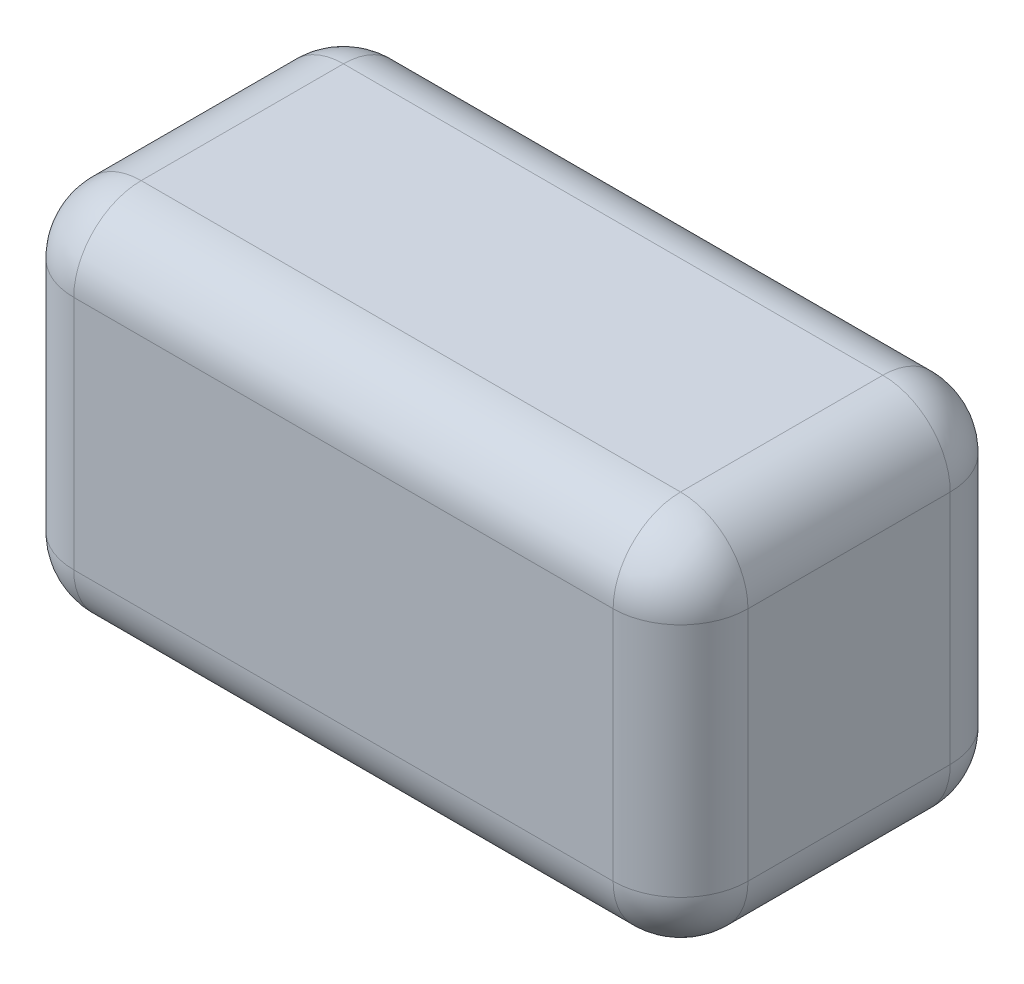
ISO-10303-21;
HEADER;
FILE_DESCRIPTION(('STEP AP214'),'2;1');
FILE_NAME('part.step','',(''),(''),'','','');
FILE_SCHEMA(('AUTOMOTIVE_DESIGN { 1 0 10303 214 1 1 1 1 }'));
ENDSEC;
DATA;
#1=APPLICATION_CONTEXT('core data for automotive mechanical design processes');
#2=APPLICATION_PROTOCOL_DEFINITION('international standard','automotive_design',2000,#1);
#3=PRODUCT_CONTEXT('',#1,'mechanical');
#4=PRODUCT('Part','Part','',(#3));
#5=PRODUCT_RELATED_PRODUCT_CATEGORY('part','',(#4));
#6=PRODUCT_DEFINITION_FORMATION('','',#4);
#7=PRODUCT_DEFINITION_CONTEXT('part definition',#1,'design');
#8=PRODUCT_DEFINITION('design','',#6,#7);
#9=PRODUCT_DEFINITION_SHAPE('','',#8);
#10=(LENGTH_UNIT() NAMED_UNIT(*) SI_UNIT(.MILLI.,.METRE.));
#11=(NAMED_UNIT(*) PLANE_ANGLE_UNIT() SI_UNIT($,.RADIAN.));
#12=(NAMED_UNIT(*) SI_UNIT($,.STERADIAN.) SOLID_ANGLE_UNIT());
#13=UNCERTAINTY_MEASURE_WITH_UNIT(LENGTH_MEASURE(1.E-05),#10,'distance_accuracy_value','');
#14=(GEOMETRIC_REPRESENTATION_CONTEXT(3) GLOBAL_UNCERTAINTY_ASSIGNED_CONTEXT((#13)) GLOBAL_UNIT_ASSIGNED_CONTEXT((#10,
#11,#12)) REPRESENTATION_CONTEXT('',''));
#15=CARTESIAN_POINT('',(0.,0.,0.));
#16=DIRECTION('',(0.,0.,1.));
#17=DIRECTION('',(1.,0.,0.));
#18=AXIS2_PLACEMENT_3D('',#15,#16,#17);
#19=CARTESIAN_POINT('',(0.4,0.1,-0.15));
#20=DIRECTION('',(1.,0.,0.));
#21=DIRECTION('',(0.,0.,-1.));
#22=AXIS2_PLACEMENT_3D('',#19,#20,#21);
#23=SPHERICAL_SURFACE('',#22,0.1);
#24=CARTESIAN_POINT('',(0.4,0.1,-0.15));
#25=DIRECTION('',(1.,0.,0.));
#26=DIRECTION('',(0.,0.,-1.));
#27=AXIS2_PLACEMENT_3D('',#24,#25,#26);
#28=CIRCLE('',#27,0.1);
#29=CARTESIAN_POINT('',(0.4,0.1,-0.25));
#30=VERTEX_POINT('',#29);
#31=CARTESIAN_POINT('',(0.4,0.,-0.149999999999904));
#32=VERTEX_POINT('',#31);
#33=EDGE_CURVE('E129',#30,#32,#28,.F.);
#34=ORIENTED_EDGE('',*,*,#33,.F.);
#35=CARTESIAN_POINT('',(0.4,0.1,-0.15));
#36=DIRECTION('',(0.,-1.,0.));
#37=DIRECTION('',(0.,0.,-1.));
#38=AXIS2_PLACEMENT_3D('',#35,#36,#37);
#39=CIRCLE('',#38,0.1);
#40=CARTESIAN_POINT('',(0.5,0.1,-0.15));
#41=VERTEX_POINT('',#40);
#42=EDGE_CURVE('E127',#41,#30,#39,.F.);
#43=ORIENTED_EDGE('',*,*,#42,.F.);
#44=CARTESIAN_POINT('',(0.4,0.1,-0.15));
#45=DIRECTION('',(0.,0.,1.));
#46=DIRECTION('',(1.,0.,0.));
#47=AXIS2_PLACEMENT_3D('',#44,#45,#46);
#48=CIRCLE('',#47,0.1);
#49=EDGE_CURVE('E270',#32,#41,#48,.T.);
#50=ORIENTED_EDGE('',*,*,#49,.F.);
#51=EDGE_LOOP('',(#34,#43,#50));
#52=FACE_BOUND('',#51,.T.);
#53=ADVANCED_FACE('F17',(#52),#23,.T.);
#54=CARTESIAN_POINT('',(-0.4,0.1,-0.15));
#55=DIRECTION('',(1.,0.,0.));
#56=DIRECTION('',(0.,0.,-1.));
#57=AXIS2_PLACEMENT_3D('',#54,#55,#56);
#58=SPHERICAL_SURFACE('',#57,0.1);
#59=CARTESIAN_POINT('',(-0.4,0.1,-0.15));
#60=DIRECTION('',(0.,-1.,0.));
#61=DIRECTION('',(0.,0.,-1.));
#62=AXIS2_PLACEMENT_3D('',#59,#60,#61);
#63=CIRCLE('',#62,0.1);
#64=CARTESIAN_POINT('',(-0.4,0.1,-0.25));
#65=VERTEX_POINT('',#64);
#66=CARTESIAN_POINT('',(-0.5,0.1,-0.15));
#67=VERTEX_POINT('',#66);
#68=EDGE_CURVE('E266',#65,#67,#63,.F.);
#69=ORIENTED_EDGE('',*,*,#68,.F.);
#70=CARTESIAN_POINT('',(-0.4,0.1,-0.15));
#71=DIRECTION('',(1.,0.,0.));
#72=DIRECTION('',(0.,0.,-1.));
#73=AXIS2_PLACEMENT_3D('',#70,#71,#72);
#74=CIRCLE('',#73,0.1);
#75=CARTESIAN_POINT('',(-0.4,0.,-0.15));
#76=VERTEX_POINT('',#75);
#77=EDGE_CURVE('E268',#76,#65,#74,.T.);
#78=ORIENTED_EDGE('',*,*,#77,.F.);
#79=CARTESIAN_POINT('',(-0.4,0.1,-0.15));
#80=DIRECTION('',(0.,0.,-1.));
#81=DIRECTION('',(-1.,0.,0.));
#82=AXIS2_PLACEMENT_3D('',#79,#80,#81);
#83=CIRCLE('',#82,0.1);
#84=EDGE_CURVE('E260',#67,#76,#83,.F.);
#85=ORIENTED_EDGE('',*,*,#84,.F.);
#86=EDGE_LOOP('',(#69,#78,#85));
#87=FACE_BOUND('',#86,.T.);
#88=ADVANCED_FACE('F157',(#87),#58,.T.);
#89=CARTESIAN_POINT('',(-0.4,0.45,-0.15));
#90=DIRECTION('',(1.,0.,0.));
#91=DIRECTION('',(0.,0.,-1.));
#92=AXIS2_PLACEMENT_3D('',#89,#90,#91);
#93=SPHERICAL_SURFACE('',#92,0.1);
#94=CARTESIAN_POINT('',(-0.4,0.45,-0.15));
#95=DIRECTION('',(0.,0.,1.));
#96=DIRECTION('',(1.,0.,0.));
#97=AXIS2_PLACEMENT_3D('',#94,#95,#96);
#98=CIRCLE('',#97,0.1);
#99=CARTESIAN_POINT('',(-0.4,0.55,-0.150000000000096));
#100=VERTEX_POINT('',#99);
#101=CARTESIAN_POINT('',(-0.5,0.45,-0.15));
#102=VERTEX_POINT('',#101);
#103=EDGE_CURVE('E257',#100,#102,#98,.T.);
#104=ORIENTED_EDGE('',*,*,#103,.F.);
#105=CARTESIAN_POINT('',(-0.4,0.45,-0.15));
#106=DIRECTION('',(-1.,0.,0.));
#107=DIRECTION('',(0.,0.,1.));
#108=AXIS2_PLACEMENT_3D('',#105,#106,#107);
#109=CIRCLE('',#108,0.1);
#110=CARTESIAN_POINT('',(-0.4,0.45,-0.25));
#111=VERTEX_POINT('',#110);
#112=EDGE_CURVE('E139',#111,#100,#109,.F.);
#113=ORIENTED_EDGE('',*,*,#112,.F.);
#114=CARTESIAN_POINT('',(-0.4,0.45,-0.15));
#115=DIRECTION('',(0.,-1.,0.));
#116=DIRECTION('',(0.,0.,-1.));
#117=AXIS2_PLACEMENT_3D('',#114,#115,#116);
#118=CIRCLE('',#117,0.1);
#119=EDGE_CURVE('E264',#102,#111,#118,.T.);
#120=ORIENTED_EDGE('',*,*,#119,.F.);
#121=EDGE_LOOP('',(#104,#113,#120));
#122=FACE_BOUND('',#121,.T.);
#123=ADVANCED_FACE('F154',(#122),#93,.T.);
#124=CARTESIAN_POINT('',(0.4,0.45,-0.15));
#125=DIRECTION('',(1.,0.,0.));
#126=DIRECTION('',(0.,0.,-1.));
#127=AXIS2_PLACEMENT_3D('',#124,#125,#126);
#128=SPHERICAL_SURFACE('',#127,0.1);
#129=CARTESIAN_POINT('',(0.4,0.45,-0.15));
#130=DIRECTION('',(0.,0.,-1.));
#131=DIRECTION('',(-1.,0.,0.));
#132=AXIS2_PLACEMENT_3D('',#129,#130,#131);
#133=CIRCLE('',#132,0.1);
#134=CARTESIAN_POINT('',(0.5,0.45,-0.15));
#135=VERTEX_POINT('',#134);
#136=CARTESIAN_POINT('',(0.4,0.55,-0.15));
#137=VERTEX_POINT('',#136);
#138=EDGE_CURVE('E142',#135,#137,#133,.F.);
#139=ORIENTED_EDGE('',*,*,#138,.F.);
#140=CARTESIAN_POINT('',(0.4,0.45,-0.15));
#141=DIRECTION('',(0.,-1.,0.));
#142=DIRECTION('',(0.,0.,-1.));
#143=AXIS2_PLACEMENT_3D('',#140,#141,#142);
#144=CIRCLE('',#143,0.1);
#145=CARTESIAN_POINT('',(0.4,0.45,-0.25));
#146=VERTEX_POINT('',#145);
#147=EDGE_CURVE('E124',#146,#135,#144,.T.);
#148=ORIENTED_EDGE('',*,*,#147,.F.);
#149=CARTESIAN_POINT('',(0.4,0.45,-0.15));
#150=DIRECTION('',(-1.,0.,0.));
#151=DIRECTION('',(0.,0.,1.));
#152=AXIS2_PLACEMENT_3D('',#149,#150,#151);
#153=CIRCLE('',#152,0.1);
#154=EDGE_CURVE('E132',#137,#146,#153,.T.);
#155=ORIENTED_EDGE('',*,*,#154,.F.);
#156=EDGE_LOOP('',(#139,#148,#155));
#157=FACE_BOUND('',#156,.T.);
#158=ADVANCED_FACE('F141',(#157),#128,.T.);
#159=CARTESIAN_POINT('',(0.4,0.55,-0.15));
#160=DIRECTION('',(0.,-1.,0.));
#161=DIRECTION('',(0.,0.,-1.));
#162=AXIS2_PLACEMENT_3D('',#159,#160,#161);
#163=CYLINDRICAL_SURFACE('',#162,0.1);
#164=ORIENTED_EDGE('',*,*,#42,.T.);
#165=DIRECTION('',(0.,-1.,0.));
#166=VECTOR('',#165,1.);
#167=CARTESIAN_POINT('',(0.4,0.55,-0.25));
#168=LINE('',#167,#166);
#169=EDGE_CURVE('E110',#30,#146,#168,.F.);
#170=ORIENTED_EDGE('',*,*,#169,.T.);
#171=ORIENTED_EDGE('',*,*,#147,.T.);
#172=DIRECTION('',(0.,1.,0.));
#173=VECTOR('',#172,1.);
#174=CARTESIAN_POINT('',(0.5,0.55,-0.15));
#175=LINE('',#174,#173);
#176=EDGE_CURVE('E249',#135,#41,#175,.F.);
#177=ORIENTED_EDGE('',*,*,#176,.T.);
#178=EDGE_LOOP('',(#164,#170,#171,#177));
#179=FACE_BOUND('',#178,.T.);
#180=ADVANCED_FACE('F121',(#179),#163,.T.);
#181=CARTESIAN_POINT('',(0.4,0.1,0.25));
#182=DIRECTION('',(0.,0.,1.));
#183=DIRECTION('',(1.,0.,0.));
#184=AXIS2_PLACEMENT_3D('',#181,#182,#183);
#185=CYLINDRICAL_SURFACE('',#184,0.1);
#186=ORIENTED_EDGE('',*,*,#49,.T.);
#187=DIRECTION('',(0.,0.,1.));
#188=VECTOR('',#187,1.);
#189=CARTESIAN_POINT('',(0.5,0.1,0.25));
#190=LINE('',#189,#188);
#191=CARTESIAN_POINT('',(0.5,0.1,0.15));
#192=VERTEX_POINT('',#191);
#193=EDGE_CURVE('E138',#41,#192,#190,.T.);
#194=ORIENTED_EDGE('',*,*,#193,.T.);
#195=CARTESIAN_POINT('',(0.4,0.1,0.15));
#196=DIRECTION('',(0.,0.,-1.));
#197=DIRECTION('',(1.,0.,0.));
#198=AXIS2_PLACEMENT_3D('',#195,#196,#197);
#199=CIRCLE('',#198,0.1);
#200=CARTESIAN_POINT('',(0.4,0.,0.15));
#201=VERTEX_POINT('',#200);
#202=EDGE_CURVE('E243',#201,#192,#199,.F.);
#203=ORIENTED_EDGE('',*,*,#202,.F.);
#204=DIRECTION('',(0.,0.,-1.));
#205=VECTOR('',#204,1.);
#206=CARTESIAN_POINT('',(0.4,0.,-0.25));
#207=LINE('',#206,#205);
#208=EDGE_CURVE('E245',#32,#201,#207,.F.);
#209=ORIENTED_EDGE('',*,*,#208,.F.);
#210=EDGE_LOOP('',(#186,#194,#203,#209));
#211=FACE_BOUND('',#210,.T.);
#212=ADVANCED_FACE('F278',(#211),#185,.T.);
#213=CARTESIAN_POINT('',(-0.4,0.55,-0.15));
#214=DIRECTION('',(0.,-1.,0.));
#215=DIRECTION('',(0.,0.,-1.));
#216=AXIS2_PLACEMENT_3D('',#213,#214,#215);
#217=CYLINDRICAL_SURFACE('',#216,0.1);
#218=ORIENTED_EDGE('',*,*,#119,.T.);
#219=DIRECTION('',(0.,-1.,0.));
#220=VECTOR('',#219,1.);
#221=CARTESIAN_POINT('',(-0.4,0.55,-0.25));
#222=LINE('',#221,#220);
#223=EDGE_CURVE('E112',#111,#65,#222,.T.);
#224=ORIENTED_EDGE('',*,*,#223,.T.);
#225=ORIENTED_EDGE('',*,*,#68,.T.);
#226=DIRECTION('',(0.,1.,0.));
#227=VECTOR('',#226,1.);
#228=CARTESIAN_POINT('',(-0.5,0.55,-0.15));
#229=LINE('',#228,#227);
#230=EDGE_CURVE('E585',#67,#102,#229,.T.);
#231=ORIENTED_EDGE('',*,*,#230,.T.);
#232=EDGE_LOOP('',(#218,#224,#225,#231));
#233=FACE_BOUND('',#232,.T.);
#234=ADVANCED_FACE('F356',(#233),#217,.T.);
#235=CARTESIAN_POINT('',(-0.4,0.1,0.25));
#236=DIRECTION('',(0.,0.,-1.));
#237=DIRECTION('',(-1.,0.,0.));
#238=AXIS2_PLACEMENT_3D('',#235,#236,#237);
#239=CYLINDRICAL_SURFACE('',#238,0.1);
#240=ORIENTED_EDGE('',*,*,#84,.T.);
#241=DIRECTION('',(0.,0.,-1.));
#242=VECTOR('',#241,1.);
#243=CARTESIAN_POINT('',(-0.4,0.,-0.25));
#244=LINE('',#243,#242);
#245=CARTESIAN_POINT('',(-0.4,0.,0.149999999999976));
#246=VERTEX_POINT('',#245);
#247=EDGE_CURVE('E241',#246,#76,#244,.T.);
#248=ORIENTED_EDGE('',*,*,#247,.F.);
#249=CARTESIAN_POINT('',(-0.4,0.1,0.15));
#250=DIRECTION('',(0.,1.916505332693E-12,-1.));
#251=DIRECTION('',(1.,0.,0.));
#252=AXIS2_PLACEMENT_3D('',#249,#250,#251);
#253=CIRCLE('',#252,0.1);
#254=CARTESIAN_POINT('',(-0.5,0.1,0.15));
#255=VERTEX_POINT('',#254);
#256=EDGE_CURVE('E219',#255,#246,#253,.F.);
#257=ORIENTED_EDGE('',*,*,#256,.F.);
#258=DIRECTION('',(0.,0.,-1.));
#259=VECTOR('',#258,1.);
#260=CARTESIAN_POINT('',(-0.5,0.1,0.25));
#261=LINE('',#260,#259);
#262=EDGE_CURVE('E587',#255,#67,#261,.T.);
#263=ORIENTED_EDGE('',*,*,#262,.T.);
#264=EDGE_LOOP('',(#240,#248,#257,#263));
#265=FACE_BOUND('',#264,.T.);
#266=ADVANCED_FACE('F353',(#265),#239,.T.);
#267=CARTESIAN_POINT('',(0.4,0.45,-0.25));
#268=DIRECTION('',(0.,0.,-1.));
#269=DIRECTION('',(-1.,0.,0.));
#270=AXIS2_PLACEMENT_3D('',#267,#268,#269);
#271=CYLINDRICAL_SURFACE('',#270,0.1);
#272=ORIENTED_EDGE('',*,*,#138,.T.);
#273=DIRECTION('',(0.,0.,-1.));
#274=VECTOR('',#273,1.);
#275=CARTESIAN_POINT('',(0.4,0.55,-0.25));
#276=LINE('',#275,#274);
#277=CARTESIAN_POINT('',(0.4,0.55,0.15));
#278=VERTEX_POINT('',#277);
#279=EDGE_CURVE('E211',#137,#278,#276,.F.);
#280=ORIENTED_EDGE('',*,*,#279,.T.);
#281=CARTESIAN_POINT('',(0.4,0.45,0.15));
#282=DIRECTION('',(0.,0.,1.));
#283=DIRECTION('',(1.,0.,0.));
#284=AXIS2_PLACEMENT_3D('',#281,#282,#283);
#285=CIRCLE('',#284,0.1);
#286=CARTESIAN_POINT('',(0.5,0.45,0.15));
#287=VERTEX_POINT('',#286);
#288=EDGE_CURVE('E213',#287,#278,#285,.T.);
#289=ORIENTED_EDGE('',*,*,#288,.F.);
#290=DIRECTION('',(0.,0.,1.));
#291=VECTOR('',#290,1.);
#292=CARTESIAN_POINT('',(0.5,0.45,0.25));
#293=LINE('',#292,#291);
#294=EDGE_CURVE('E251',#287,#135,#293,.F.);
#295=ORIENTED_EDGE('',*,*,#294,.T.);
#296=EDGE_LOOP('',(#272,#280,#289,#295));
#297=FACE_BOUND('',#296,.T.);
#298=ADVANCED_FACE('F306',(#297),#271,.T.);
#299=CARTESIAN_POINT('',(-0.4,0.45,-0.25));
#300=DIRECTION('',(0.,0.,1.));
#301=DIRECTION('',(1.,0.,0.));
#302=AXIS2_PLACEMENT_3D('',#299,#300,#301);
#303=CYLINDRICAL_SURFACE('',#302,0.1);
#304=ORIENTED_EDGE('',*,*,#103,.T.);
#305=DIRECTION('',(0.,0.,-1.));
#306=VECTOR('',#305,1.);
#307=CARTESIAN_POINT('',(-0.5,0.45,0.25));
#308=LINE('',#307,#306);
#309=CARTESIAN_POINT('',(-0.5,0.45,0.15));
#310=VERTEX_POINT('',#309);
#311=EDGE_CURVE('E580',#102,#310,#308,.F.);
#312=ORIENTED_EDGE('',*,*,#311,.T.);
#313=CARTESIAN_POINT('',(-0.4,0.45,0.15));
#314=DIRECTION('',(0.,0.,1.));
#315=DIRECTION('',(1.,0.,0.));
#316=AXIS2_PLACEMENT_3D('',#313,#314,#315);
#317=CIRCLE('',#316,0.1);
#318=CARTESIAN_POINT('',(-0.4,0.55,0.15));
#319=VERTEX_POINT('',#318);
#320=EDGE_CURVE('E215',#319,#310,#317,.T.);
#321=ORIENTED_EDGE('',*,*,#320,.F.);
#322=DIRECTION('',(0.,0.,-1.));
#323=VECTOR('',#322,1.);
#324=CARTESIAN_POINT('',(-0.4,0.55,-0.25));
#325=LINE('',#324,#323);
#326=EDGE_CURVE('E118',#319,#100,#325,.T.);
#327=ORIENTED_EDGE('',*,*,#326,.T.);
#328=EDGE_LOOP('',(#304,#312,#321,#327));
#329=FACE_BOUND('',#328,.T.);
#330=ADVANCED_FACE('F346',(#329),#303,.T.);
#331=CARTESIAN_POINT('',(-0.5,0.55,-0.25));
#332=DIRECTION('',(0.,0.,1.));
#333=DIRECTION('',(1.,0.,0.));
#334=AXIS2_PLACEMENT_3D('',#331,#332,#333);
#335=PLANE('',#334);
#336=DIRECTION('',(1.,0.,0.));
#337=VECTOR('',#336,1.);
#338=CARTESIAN_POINT('',(-0.5,0.1,-0.25));
#339=LINE('',#338,#337);
#340=EDGE_CURVE('E101',#65,#30,#339,.T.);
#341=ORIENTED_EDGE('',*,*,#340,.F.);
#342=ORIENTED_EDGE('',*,*,#223,.F.);
#343=DIRECTION('',(-1.,0.,0.));
#344=VECTOR('',#343,1.);
#345=CARTESIAN_POINT('',(0.5,0.45,-0.25));
#346=LINE('',#345,#344);
#347=EDGE_CURVE('E107',#146,#111,#346,.T.);
#348=ORIENTED_EDGE('',*,*,#347,.F.);
#349=ORIENTED_EDGE('',*,*,#169,.F.);
#350=EDGE_LOOP('',(#341,#342,#348,#349));
#351=FACE_BOUND('',#350,.T.);
#352=ADVANCED_FACE('F109',(#351),#335,.F.);
#353=CARTESIAN_POINT('',(0.5,0.55,0.25));
#354=DIRECTION('',(-1.,0.,0.));
#355=DIRECTION('',(0.,0.,1.));
#356=AXIS2_PLACEMENT_3D('',#353,#354,#355);
#357=PLANE('',#356);
#358=ORIENTED_EDGE('',*,*,#294,.F.);
#359=DIRECTION('',(0.,-1.,0.));
#360=VECTOR('',#359,1.);
#361=CARTESIAN_POINT('',(0.5,0.55,0.15));
#362=LINE('',#361,#360);
#363=EDGE_CURVE('E285',#192,#287,#362,.F.);
#364=ORIENTED_EDGE('',*,*,#363,.F.);
#365=ORIENTED_EDGE('',*,*,#193,.F.);
#366=ORIENTED_EDGE('',*,*,#176,.F.);
#367=EDGE_LOOP('',(#358,#364,#365,#366));
#368=FACE_BOUND('',#367,.T.);
#369=ADVANCED_FACE('F340',(#368),#357,.F.);
#370=CARTESIAN_POINT('',(-0.5,0.1,-0.15));
#371=DIRECTION('',(1.,0.,0.));
#372=DIRECTION('',(0.,0.,-1.));
#373=AXIS2_PLACEMENT_3D('',#370,#371,#372);
#374=CYLINDRICAL_SURFACE('',#373,0.1);
#375=ORIENTED_EDGE('',*,*,#340,.T.);
#376=ORIENTED_EDGE('',*,*,#33,.T.);
#377=DIRECTION('',(1.,0.,0.));
#378=VECTOR('',#377,1.);
#379=CARTESIAN_POINT('',(0.5,0.,-0.15));
#380=LINE('',#379,#378);
#381=EDGE_CURVE('E273',#76,#32,#380,.T.);
#382=ORIENTED_EDGE('',*,*,#381,.F.);
#383=ORIENTED_EDGE('',*,*,#77,.T.);
#384=EDGE_LOOP('',(#375,#376,#382,#383));
#385=FACE_BOUND('',#384,.T.);
#386=ADVANCED_FACE('F235',(#385),#374,.T.);
#387=CARTESIAN_POINT('',(0.4,0.1,0.15));
#388=DIRECTION('',(1.,0.,0.));
#389=DIRECTION('',(0.,0.,-1.));
#390=AXIS2_PLACEMENT_3D('',#387,#388,#389);
#391=SPHERICAL_SURFACE('',#390,0.1);
#392=CARTESIAN_POINT('',(0.4,0.1,0.15));
#393=DIRECTION('',(-1.,0.,0.));
#394=DIRECTION('',(0.,0.,1.));
#395=AXIS2_PLACEMENT_3D('',#392,#393,#394);
#396=CIRCLE('',#395,0.1);
#397=CARTESIAN_POINT('',(0.4,0.0999999999999521,0.25));
#398=VERTEX_POINT('',#397);
#399=EDGE_CURVE('E284',#201,#398,#396,.T.);
#400=ORIENTED_EDGE('',*,*,#399,.F.);
#401=ORIENTED_EDGE('',*,*,#202,.T.);
#402=CARTESIAN_POINT('',(0.4,0.1,0.15));
#403=DIRECTION('',(0.,-1.,0.));
#404=DIRECTION('',(0.,0.,-1.));
#405=AXIS2_PLACEMENT_3D('',#402,#403,#404);
#406=CIRCLE('',#405,0.1);
#407=EDGE_CURVE('E291',#398,#192,#406,.F.);
#408=ORIENTED_EDGE('',*,*,#407,.F.);
#409=EDGE_LOOP('',(#400,#401,#408));
#410=FACE_BOUND('',#409,.T.);
#411=ADVANCED_FACE('F230',(#410),#391,.T.);
#412=CARTESIAN_POINT('',(-0.5,0.55,0.25));
#413=DIRECTION('',(1.,0.,0.));
#414=DIRECTION('',(0.,0.,-1.));
#415=AXIS2_PLACEMENT_3D('',#412,#413,#414);
#416=PLANE('',#415);
#417=ORIENTED_EDGE('',*,*,#311,.F.);
#418=ORIENTED_EDGE('',*,*,#230,.F.);
#419=ORIENTED_EDGE('',*,*,#262,.F.);
#420=DIRECTION('',(0.,-1.,0.));
#421=VECTOR('',#420,1.);
#422=CARTESIAN_POINT('',(-0.5,0.55,0.15));
#423=LINE('',#422,#421);
#424=EDGE_CURVE('E321',#310,#255,#423,.T.);
#425=ORIENTED_EDGE('',*,*,#424,.F.);
#426=EDGE_LOOP('',(#417,#418,#419,#425));
#427=FACE_BOUND('',#426,.T.);
#428=ADVANCED_FACE('F226',(#427),#416,.F.);
#429=CARTESIAN_POINT('',(-0.4,0.1,0.15));
#430=DIRECTION('',(1.,0.,0.));
#431=DIRECTION('',(0.,0.,-1.));
#432=AXIS2_PLACEMENT_3D('',#429,#430,#431);
#433=SPHERICAL_SURFACE('',#432,0.1);
#434=CARTESIAN_POINT('',(-0.4,0.1,0.15));
#435=DIRECTION('',(0.,-1.,0.));
#436=DIRECTION('',(0.,0.,-1.));
#437=AXIS2_PLACEMENT_3D('',#434,#435,#436);
#438=CIRCLE('',#437,0.1);
#439=CARTESIAN_POINT('',(-0.4,0.1,0.25));
#440=VERTEX_POINT('',#439);
#441=EDGE_CURVE('E315',#255,#440,#438,.F.);
#442=ORIENTED_EDGE('',*,*,#441,.F.);
#443=ORIENTED_EDGE('',*,*,#256,.T.);
#444=CARTESIAN_POINT('',(-0.4,0.1,0.15));
#445=DIRECTION('',(-1.,0.,0.));
#446=DIRECTION('',(0.,0.,1.));
#447=AXIS2_PLACEMENT_3D('',#444,#445,#446);
#448=CIRCLE('',#447,0.1);
#449=EDGE_CURVE('E288',#440,#246,#448,.F.);
#450=ORIENTED_EDGE('',*,*,#449,.F.);
#451=EDGE_LOOP('',(#442,#443,#450));
#452=FACE_BOUND('',#451,.T.);
#453=ADVANCED_FACE('F223',(#452),#433,.T.);
#454=CARTESIAN_POINT('',(-0.4,0.45,0.15));
#455=DIRECTION('',(1.,0.,0.));
#456=DIRECTION('',(0.,0.,-1.));
#457=AXIS2_PLACEMENT_3D('',#454,#455,#456);
#458=SPHERICAL_SURFACE('',#457,0.1);
#459=CARTESIAN_POINT('',(-0.4,0.45,0.15));
#460=DIRECTION('',(0.,-1.,0.));
#461=DIRECTION('',(0.,0.,-1.));
#462=AXIS2_PLACEMENT_3D('',#459,#460,#461);
#463=CIRCLE('',#462,0.1);
#464=CARTESIAN_POINT('',(-0.4,0.449999999999808,0.25));
#465=VERTEX_POINT('',#464);
#466=EDGE_CURVE('E324',#465,#310,#463,.T.);
#467=ORIENTED_EDGE('',*,*,#466,.F.);
#468=CARTESIAN_POINT('',(-0.4,0.45,0.15));
#469=DIRECTION('',(1.,0.,0.));
#470=DIRECTION('',(0.,0.,-1.));
#471=AXIS2_PLACEMENT_3D('',#468,#469,#470);
#472=CIRCLE('',#471,0.1);
#473=EDGE_CURVE('E311',#319,#465,#472,.T.);
#474=ORIENTED_EDGE('',*,*,#473,.F.);
#475=ORIENTED_EDGE('',*,*,#320,.T.);
#476=EDGE_LOOP('',(#467,#474,#475));
#477=FACE_BOUND('',#476,.T.);
#478=ADVANCED_FACE('F204',(#477),#458,.T.);
#479=CARTESIAN_POINT('',(0.4,0.45,0.15));
#480=DIRECTION('',(1.,0.,0.));
#481=DIRECTION('',(0.,0.,-1.));
#482=AXIS2_PLACEMENT_3D('',#479,#480,#481);
#483=SPHERICAL_SURFACE('',#482,0.1);
#484=CARTESIAN_POINT('',(0.4,0.45,0.15));
#485=DIRECTION('',(0.,-1.,0.));
#486=DIRECTION('',(0.,0.,-1.));
#487=AXIS2_PLACEMENT_3D('',#484,#485,#486);
#488=CIRCLE('',#487,0.1);
#489=CARTESIAN_POINT('',(0.4,0.45,0.25));
#490=VERTEX_POINT('',#489);
#491=EDGE_CURVE('E117',#287,#490,#488,.T.);
#492=ORIENTED_EDGE('',*,*,#491,.F.);
#493=ORIENTED_EDGE('',*,*,#288,.T.);
#494=CARTESIAN_POINT('',(0.4,0.45,0.15));
#495=DIRECTION('',(1.,0.,0.));
#496=DIRECTION('',(0.,0.,-1.));
#497=AXIS2_PLACEMENT_3D('',#494,#495,#496);
#498=CIRCLE('',#497,0.1);
#499=EDGE_CURVE('E308',#490,#278,#498,.F.);
#500=ORIENTED_EDGE('',*,*,#499,.F.);
#501=EDGE_LOOP('',(#492,#493,#500));
#502=FACE_BOUND('',#501,.T.);
#503=ADVANCED_FACE('F200',(#502),#483,.T.);
#504=CARTESIAN_POINT('',(0.5,0.45,-0.15));
#505=DIRECTION('',(-1.,0.,0.));
#506=DIRECTION('',(0.,0.,1.));
#507=AXIS2_PLACEMENT_3D('',#504,#505,#506);
#508=CYLINDRICAL_SURFACE('',#507,0.1);
#509=DIRECTION('',(1.,0.,0.));
#510=VECTOR('',#509,1.);
#511=CARTESIAN_POINT('',(0.5,0.55,-0.15));
#512=LINE('',#511,#510);
#513=EDGE_CURVE('E134',#100,#137,#512,.T.);
#514=ORIENTED_EDGE('',*,*,#513,.T.);
#515=ORIENTED_EDGE('',*,*,#154,.T.);
#516=ORIENTED_EDGE('',*,*,#347,.T.);
#517=ORIENTED_EDGE('',*,*,#112,.T.);
#518=EDGE_LOOP('',(#514,#515,#516,#517));
#519=FACE_BOUND('',#518,.T.);
#520=ADVANCED_FACE('F133',(#519),#508,.T.);
#521=CARTESIAN_POINT('',(0.4,0.55,0.15));
#522=DIRECTION('',(0.,-1.,0.));
#523=DIRECTION('',(0.,0.,-1.));
#524=AXIS2_PLACEMENT_3D('',#521,#522,#523);
#525=CYLINDRICAL_SURFACE('',#524,0.1);
#526=ORIENTED_EDGE('',*,*,#407,.T.);
#527=ORIENTED_EDGE('',*,*,#363,.T.);
#528=ORIENTED_EDGE('',*,*,#491,.T.);
#529=DIRECTION('',(0.,1.,0.));
#530=VECTOR('',#529,1.);
#531=CARTESIAN_POINT('',(0.4,0.55,0.25));
#532=LINE('',#531,#530);
#533=EDGE_CURVE('E313',#490,#398,#532,.F.);
#534=ORIENTED_EDGE('',*,*,#533,.T.);
#535=EDGE_LOOP('',(#526,#527,#528,#534));
#536=FACE_BOUND('',#535,.T.);
#537=ADVANCED_FACE('F193',(#536),#525,.T.);
#538=CARTESIAN_POINT('',(0.5,0.,-0.25));
#539=DIRECTION('',(0.,-1.,0.));
#540=DIRECTION('',(0.,0.,-1.));
#541=AXIS2_PLACEMENT_3D('',#538,#539,#540);
#542=PLANE('',#541);
#543=ORIENTED_EDGE('',*,*,#381,.T.);
#544=ORIENTED_EDGE('',*,*,#208,.T.);
#545=DIRECTION('',(-1.,0.,0.));
#546=VECTOR('',#545,1.);
#547=CARTESIAN_POINT('',(-0.5,0.,0.15));
#548=LINE('',#547,#546);
#549=EDGE_CURVE('E281',#246,#201,#548,.F.);
#550=ORIENTED_EDGE('',*,*,#549,.F.);
#551=ORIENTED_EDGE('',*,*,#247,.T.);
#552=EDGE_LOOP('',(#543,#544,#550,#551));
#553=FACE_BOUND('',#552,.T.);
#554=ADVANCED_FACE('F189',(#553),#542,.T.);
#555=CARTESIAN_POINT('',(-0.4,0.55,0.15));
#556=DIRECTION('',(0.,-1.,0.));
#557=DIRECTION('',(0.,0.,-1.));
#558=AXIS2_PLACEMENT_3D('',#555,#556,#557);
#559=CYLINDRICAL_SURFACE('',#558,0.1);
#560=ORIENTED_EDGE('',*,*,#441,.T.);
#561=DIRECTION('',(0.,1.,0.));
#562=VECTOR('',#561,1.);
#563=CARTESIAN_POINT('',(-0.4,0.55,0.25));
#564=LINE('',#563,#562);
#565=EDGE_CURVE('E331',#440,#465,#564,.T.);
#566=ORIENTED_EDGE('',*,*,#565,.T.);
#567=ORIENTED_EDGE('',*,*,#466,.T.);
#568=ORIENTED_EDGE('',*,*,#424,.T.);
#569=EDGE_LOOP('',(#560,#566,#567,#568));
#570=FACE_BOUND('',#569,.T.);
#571=ADVANCED_FACE('F185',(#570),#559,.T.);
#572=CARTESIAN_POINT('',(0.5,0.55,-0.25));
#573=DIRECTION('',(0.,-1.,0.));
#574=DIRECTION('',(0.,0.,-1.));
#575=AXIS2_PLACEMENT_3D('',#572,#573,#574);
#576=PLANE('',#575);
#577=ORIENTED_EDGE('',*,*,#513,.F.);
#578=ORIENTED_EDGE('',*,*,#326,.F.);
#579=DIRECTION('',(1.,0.,0.));
#580=VECTOR('',#579,1.);
#581=CARTESIAN_POINT('',(0.5,0.55,0.15));
#582=LINE('',#581,#580);
#583=EDGE_CURVE('E309',#278,#319,#582,.F.);
#584=ORIENTED_EDGE('',*,*,#583,.F.);
#585=ORIENTED_EDGE('',*,*,#279,.F.);
#586=EDGE_LOOP('',(#577,#578,#584,#585));
#587=FACE_BOUND('',#586,.T.);
#588=ADVANCED_FACE('F181',(#587),#576,.F.);
#589=CARTESIAN_POINT('',(-0.5,0.1,0.15));
#590=DIRECTION('',(-1.,0.,0.));
#591=DIRECTION('',(0.,0.,1.));
#592=AXIS2_PLACEMENT_3D('',#589,#590,#591);
#593=CYLINDRICAL_SURFACE('',#592,0.1);
#594=ORIENTED_EDGE('',*,*,#549,.T.);
#595=ORIENTED_EDGE('',*,*,#399,.T.);
#596=DIRECTION('',(-1.,0.,0.));
#597=VECTOR('',#596,1.);
#598=CARTESIAN_POINT('',(-0.5,0.1,0.25));
#599=LINE('',#598,#597);
#600=EDGE_CURVE('E26',#398,#440,#599,.T.);
#601=ORIENTED_EDGE('',*,*,#600,.T.);
#602=ORIENTED_EDGE('',*,*,#449,.T.);
#603=EDGE_LOOP('',(#594,#595,#601,#602));
#604=FACE_BOUND('',#603,.T.);
#605=ADVANCED_FACE('F175',(#604),#593,.T.);
#606=CARTESIAN_POINT('',(0.5,0.45,0.15));
#607=DIRECTION('',(1.,0.,0.));
#608=DIRECTION('',(0.,0.,-1.));
#609=AXIS2_PLACEMENT_3D('',#606,#607,#608);
#610=CYLINDRICAL_SURFACE('',#609,0.1);
#611=DIRECTION('',(-1.,0.,0.));
#612=VECTOR('',#611,1.);
#613=CARTESIAN_POINT('',(-0.5,0.45,0.25));
#614=LINE('',#613,#612);
#615=EDGE_CURVE('E11',#465,#490,#614,.F.);
#616=ORIENTED_EDGE('',*,*,#615,.T.);
#617=ORIENTED_EDGE('',*,*,#499,.T.);
#618=ORIENTED_EDGE('',*,*,#583,.T.);
#619=ORIENTED_EDGE('',*,*,#473,.T.);
#620=EDGE_LOOP('',(#616,#617,#618,#619));
#621=FACE_BOUND('',#620,.T.);
#622=ADVANCED_FACE('F170',(#621),#610,.T.);
#623=CARTESIAN_POINT('',(-0.5,0.55,0.25));
#624=DIRECTION('',(0.,0.,-1.));
#625=DIRECTION('',(-1.,0.,0.));
#626=AXIS2_PLACEMENT_3D('',#623,#624,#625);
#627=PLANE('',#626);
#628=ORIENTED_EDGE('',*,*,#615,.F.);
#629=ORIENTED_EDGE('',*,*,#565,.F.);
#630=ORIENTED_EDGE('',*,*,#600,.F.);
#631=ORIENTED_EDGE('',*,*,#533,.F.);
#632=EDGE_LOOP('',(#628,#629,#630,#631));
#633=FACE_BOUND('',#632,.T.);
#634=ADVANCED_FACE('F168',(#633),#627,.F.);
#635=CLOSED_SHELL('',(#53,#88,#123,#158,#180,#212,#234,#266,#298,#330,#352,#369,#386,#411,#428,
#453,#478,#503,#520,#537,#554,#571,#588,#605,#622,#634));
#636=MANIFOLD_SOLID_BREP('B1',#635);
#637=ADVANCED_BREP_SHAPE_REPRESENTATION('',(#18,#636),#14);
#638=SHAPE_DEFINITION_REPRESENTATION(#9,#637);
ENDSEC;
END-ISO-10303-21;
